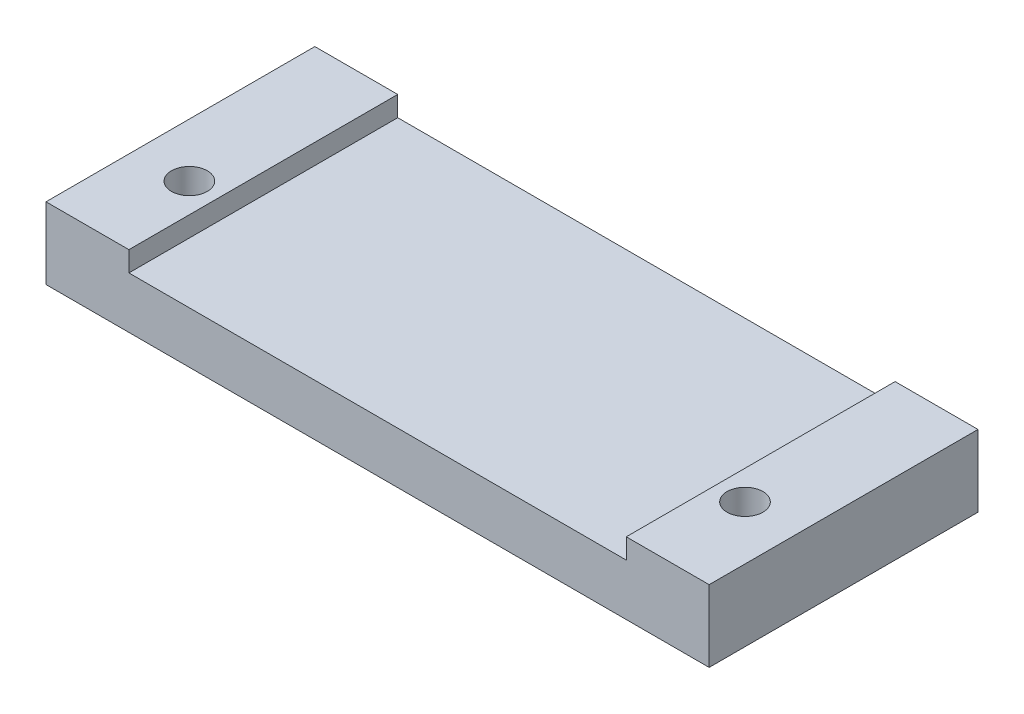
ISO-10303-21;
HEADER;
FILE_DESCRIPTION(('STEP AP214'),'2;1');
FILE_NAME('part.step','',(''),(''),'','','');
FILE_SCHEMA(('AUTOMOTIVE_DESIGN { 1 0 10303 214 1 1 1 1 }'));
ENDSEC;
DATA;
#1=APPLICATION_CONTEXT('core data for automotive mechanical design processes');
#2=APPLICATION_PROTOCOL_DEFINITION('international standard','automotive_design',2000,#1);
#3=PRODUCT_CONTEXT('',#1,'mechanical');
#4=PRODUCT('Part','Part','',(#3));
#5=PRODUCT_RELATED_PRODUCT_CATEGORY('part','',(#4));
#6=PRODUCT_DEFINITION_FORMATION('','',#4);
#7=PRODUCT_DEFINITION_CONTEXT('part definition',#1,'design');
#8=PRODUCT_DEFINITION('design','',#6,#7);
#9=PRODUCT_DEFINITION_SHAPE('','',#8);
#10=(LENGTH_UNIT() NAMED_UNIT(*) SI_UNIT(.MILLI.,.METRE.));
#11=(NAMED_UNIT(*) PLANE_ANGLE_UNIT() SI_UNIT($,.RADIAN.));
#12=(NAMED_UNIT(*) SI_UNIT($,.STERADIAN.) SOLID_ANGLE_UNIT());
#13=UNCERTAINTY_MEASURE_WITH_UNIT(LENGTH_MEASURE(1.E-05),#10,'distance_accuracy_value','');
#14=(GEOMETRIC_REPRESENTATION_CONTEXT(3) GLOBAL_UNCERTAINTY_ASSIGNED_CONTEXT((#13)) GLOBAL_UNIT_ASSIGNED_CONTEXT((#10,
#11,#12)) REPRESENTATION_CONTEXT('',''));
#15=CARTESIAN_POINT('',(0.,0.,0.));
#16=DIRECTION('',(0.,0.,1.));
#17=DIRECTION('',(1.,0.,0.));
#18=AXIS2_PLACEMENT_3D('',#15,#16,#17);
#19=CARTESIAN_POINT('',(0.,5.75,0.));
#20=DIRECTION('',(0.,-1.,0.));
#21=DIRECTION('',(0.,0.,-1.));
#22=AXIS2_PLACEMENT_3D('',#19,#20,#21);
#23=PLANE('',#22);
#24=DIRECTION('',(0.,0.,1.));
#25=VECTOR('',#24,1.);
#26=CARTESIAN_POINT('',(64.75,5.75,-30.));
#27=LINE('',#26,#25);
#28=CARTESIAN_POINT('',(64.75,5.75,-30.));
#29=VERTEX_POINT('',#28);
#30=CARTESIAN_POINT('',(64.75,5.75,0.));
#31=VERTEX_POINT('',#30);
#32=EDGE_CURVE('E114',#29,#31,#27,.T.);
#33=ORIENTED_EDGE('',*,*,#32,.F.);
#34=DIRECTION('',(-1.,0.,0.));
#35=VECTOR('',#34,1.);
#36=CARTESIAN_POINT('',(0.,5.75,-30.));
#37=LINE('',#36,#35);
#38=CARTESIAN_POINT('',(9.25,5.75,-30.));
#39=VERTEX_POINT('',#38);
#40=EDGE_CURVE('E103',#29,#39,#37,.T.);
#41=ORIENTED_EDGE('',*,*,#40,.T.);
#42=DIRECTION('',(0.,0.,-1.));
#43=VECTOR('',#42,1.);
#44=CARTESIAN_POINT('',(9.25,5.75,-30.));
#45=LINE('',#44,#43);
#46=CARTESIAN_POINT('',(9.25,5.75,0.));
#47=VERTEX_POINT('',#46);
#48=EDGE_CURVE('E59',#47,#39,#45,.T.);
#49=ORIENTED_EDGE('',*,*,#48,.F.);
#50=DIRECTION('',(1.,0.,0.));
#51=VECTOR('',#50,1.);
#52=CARTESIAN_POINT('',(0.,5.75,0.));
#53=LINE('',#52,#51);
#54=EDGE_CURVE('E54',#47,#31,#53,.T.);
#55=ORIENTED_EDGE('',*,*,#54,.T.);
#56=EDGE_LOOP('',(#33,#41,#49,#55));
#57=FACE_BOUND('',#56,.T.);
#58=ADVANCED_FACE('F39',(#57),#23,.F.);
#59=CARTESIAN_POINT('',(0.,5.75,0.));
#60=DIRECTION('',(1.,0.,0.));
#61=DIRECTION('',(0.,0.,-1.));
#62=AXIS2_PLACEMENT_3D('',#59,#60,#61);
#63=PLANE('',#62);
#64=DIRECTION('',(0.,0.,1.));
#65=VECTOR('',#64,1.);
#66=CARTESIAN_POINT('',(0.,0.,0.));
#67=LINE('',#66,#65);
#68=CARTESIAN_POINT('',(0.,0.,-30.));
#69=VERTEX_POINT('',#68);
#70=CARTESIAN_POINT('',(0.,0.,0.));
#71=VERTEX_POINT('',#70);
#72=EDGE_CURVE('E156',#69,#71,#67,.T.);
#73=ORIENTED_EDGE('',*,*,#72,.T.);
#74=DIRECTION('',(0.,-1.,0.));
#75=VECTOR('',#74,1.);
#76=CARTESIAN_POINT('',(0.,5.75,0.));
#77=LINE('',#76,#75);
#78=CARTESIAN_POINT('',(0.,8.,0.));
#79=VERTEX_POINT('',#78);
#80=EDGE_CURVE('E11',#79,#71,#77,.T.);
#81=ORIENTED_EDGE('',*,*,#80,.F.);
#82=DIRECTION('',(0.,0.,1.));
#83=VECTOR('',#82,1.);
#84=CARTESIAN_POINT('',(0.,8.,-30.));
#85=LINE('',#84,#83);
#86=CARTESIAN_POINT('',(0.,8.,-30.));
#87=VERTEX_POINT('',#86);
#88=EDGE_CURVE('E141',#87,#79,#85,.T.);
#89=ORIENTED_EDGE('',*,*,#88,.F.);
#90=DIRECTION('',(0.,-1.,0.));
#91=VECTOR('',#90,1.);
#92=CARTESIAN_POINT('',(0.,5.75,-30.));
#93=LINE('',#92,#91);
#94=EDGE_CURVE('E112',#87,#69,#93,.T.);
#95=ORIENTED_EDGE('',*,*,#94,.T.);
#96=EDGE_LOOP('',(#73,#81,#89,#95));
#97=FACE_BOUND('',#96,.T.);
#98=ADVANCED_FACE('F41',(#97),#63,.F.);
#99=CARTESIAN_POINT('',(0.,5.75,0.));
#100=DIRECTION('',(0.,0.,-1.));
#101=DIRECTION('',(-1.,0.,0.));
#102=AXIS2_PLACEMENT_3D('',#99,#100,#101);
#103=PLANE('',#102);
#104=DIRECTION('',(1.,0.,0.));
#105=VECTOR('',#104,1.);
#106=CARTESIAN_POINT('',(0.,0.,0.));
#107=LINE('',#106,#105);
#108=CARTESIAN_POINT('',(74.,0.,0.));
#109=VERTEX_POINT('',#108);
#110=EDGE_CURVE('E161',#71,#109,#107,.T.);
#111=ORIENTED_EDGE('',*,*,#110,.T.);
#112=DIRECTION('',(0.,-1.,0.));
#113=VECTOR('',#112,1.);
#114=CARTESIAN_POINT('',(74.,5.75,0.));
#115=LINE('',#114,#113);
#116=CARTESIAN_POINT('',(74.,8.,0.));
#117=VERTEX_POINT('',#116);
#118=EDGE_CURVE('E47',#117,#109,#115,.T.);
#119=ORIENTED_EDGE('',*,*,#118,.F.);
#120=DIRECTION('',(1.,0.,0.));
#121=VECTOR('',#120,1.);
#122=CARTESIAN_POINT('',(74.,8.,0.));
#123=LINE('',#122,#121);
#124=CARTESIAN_POINT('',(64.75,8.,0.));
#125=VERTEX_POINT('',#124);
#126=EDGE_CURVE('E125',#125,#117,#123,.T.);
#127=ORIENTED_EDGE('',*,*,#126,.F.);
#128=DIRECTION('',(0.,-1.,0.));
#129=VECTOR('',#128,1.);
#130=CARTESIAN_POINT('',(64.75,8.,0.));
#131=LINE('',#130,#129);
#132=EDGE_CURVE('E122',#125,#31,#131,.T.);
#133=ORIENTED_EDGE('',*,*,#132,.T.);
#134=ORIENTED_EDGE('',*,*,#54,.F.);
#135=DIRECTION('',(0.,-1.,0.));
#136=VECTOR('',#135,1.);
#137=CARTESIAN_POINT('',(9.25,8.,0.));
#138=LINE('',#137,#136);
#139=CARTESIAN_POINT('',(9.25,8.,0.));
#140=VERTEX_POINT('',#139);
#141=EDGE_CURVE('E153',#140,#47,#138,.T.);
#142=ORIENTED_EDGE('',*,*,#141,.F.);
#143=DIRECTION('',(1.,0.,0.));
#144=VECTOR('',#143,1.);
#145=CARTESIAN_POINT('',(0.,8.,0.));
#146=LINE('',#145,#144);
#147=EDGE_CURVE('E144',#79,#140,#146,.T.);
#148=ORIENTED_EDGE('',*,*,#147,.F.);
#149=ORIENTED_EDGE('',*,*,#80,.T.);
#150=EDGE_LOOP('',(#111,#119,#127,#133,#134,#142,#148,#149));
#151=FACE_BOUND('',#150,.T.);
#152=ADVANCED_FACE('F190',(#151),#103,.F.);
#153=CARTESIAN_POINT('',(74.,5.75,0.));
#154=DIRECTION('',(-1.,0.,0.));
#155=DIRECTION('',(0.,0.,1.));
#156=AXIS2_PLACEMENT_3D('',#153,#154,#155);
#157=PLANE('',#156);
#158=DIRECTION('',(0.,0.,-1.));
#159=VECTOR('',#158,1.);
#160=CARTESIAN_POINT('',(74.,0.,0.));
#161=LINE('',#160,#159);
#162=CARTESIAN_POINT('',(74.,0.,-30.));
#163=VERTEX_POINT('',#162);
#164=EDGE_CURVE('E163',#109,#163,#161,.T.);
#165=ORIENTED_EDGE('',*,*,#164,.T.);
#166=DIRECTION('',(0.,-1.,0.));
#167=VECTOR('',#166,1.);
#168=CARTESIAN_POINT('',(74.,5.75,-30.));
#169=LINE('',#168,#167);
#170=CARTESIAN_POINT('',(74.,8.,-30.));
#171=VERTEX_POINT('',#170);
#172=EDGE_CURVE('E168',#171,#163,#169,.T.);
#173=ORIENTED_EDGE('',*,*,#172,.F.);
#174=DIRECTION('',(0.,0.,-1.));
#175=VECTOR('',#174,1.);
#176=CARTESIAN_POINT('',(74.,8.,-30.));
#177=LINE('',#176,#175);
#178=EDGE_CURVE('E118',#117,#171,#177,.T.);
#179=ORIENTED_EDGE('',*,*,#178,.F.);
#180=ORIENTED_EDGE('',*,*,#118,.T.);
#181=EDGE_LOOP('',(#165,#173,#179,#180));
#182=FACE_BOUND('',#181,.T.);
#183=ADVANCED_FACE('F174',(#182),#157,.F.);
#184=CARTESIAN_POINT('',(0.,5.75,-30.));
#185=DIRECTION('',(0.,0.,1.));
#186=DIRECTION('',(1.,0.,0.));
#187=AXIS2_PLACEMENT_3D('',#184,#185,#186);
#188=PLANE('',#187);
#189=DIRECTION('',(-1.,0.,0.));
#190=VECTOR('',#189,1.);
#191=CARTESIAN_POINT('',(0.,0.,-30.));
#192=LINE('',#191,#190);
#193=EDGE_CURVE('E157',#163,#69,#192,.T.);
#194=ORIENTED_EDGE('',*,*,#193,.T.);
#195=ORIENTED_EDGE('',*,*,#94,.F.);
#196=DIRECTION('',(-1.,0.,0.));
#197=VECTOR('',#196,1.);
#198=CARTESIAN_POINT('',(0.,8.,-30.));
#199=LINE('',#198,#197);
#200=CARTESIAN_POINT('',(9.25,8.,-30.));
#201=VERTEX_POINT('',#200);
#202=EDGE_CURVE('E148',#201,#87,#199,.T.);
#203=ORIENTED_EDGE('',*,*,#202,.F.);
#204=DIRECTION('',(0.,-1.,0.));
#205=VECTOR('',#204,1.);
#206=CARTESIAN_POINT('',(9.25,8.,-30.));
#207=LINE('',#206,#205);
#208=EDGE_CURVE('E111',#201,#39,#207,.T.);
#209=ORIENTED_EDGE('',*,*,#208,.T.);
#210=ORIENTED_EDGE('',*,*,#40,.F.);
#211=DIRECTION('',(0.,-1.,0.));
#212=VECTOR('',#211,1.);
#213=CARTESIAN_POINT('',(64.75,8.,-30.));
#214=LINE('',#213,#212);
#215=CARTESIAN_POINT('',(64.75,8.,-30.));
#216=VERTEX_POINT('',#215);
#217=EDGE_CURVE('E107',#216,#29,#214,.T.);
#218=ORIENTED_EDGE('',*,*,#217,.F.);
#219=DIRECTION('',(-1.,0.,0.));
#220=VECTOR('',#219,1.);
#221=CARTESIAN_POINT('',(74.,8.,-30.));
#222=LINE('',#221,#220);
#223=EDGE_CURVE('E137',#171,#216,#222,.T.);
#224=ORIENTED_EDGE('',*,*,#223,.F.);
#225=ORIENTED_EDGE('',*,*,#172,.T.);
#226=EDGE_LOOP('',(#194,#195,#203,#209,#210,#218,#224,#225));
#227=FACE_BOUND('',#226,.T.);
#228=ADVANCED_FACE('F104',(#227),#188,.F.);
#229=CARTESIAN_POINT('',(0.,0.,0.));
#230=DIRECTION('',(0.,-1.,0.));
#231=DIRECTION('',(0.,0.,-1.));
#232=AXIS2_PLACEMENT_3D('',#229,#230,#231);
#233=PLANE('',#232);
#234=CARTESIAN_POINT('',(68.,0.,-10.));
#235=DIRECTION('',(0.,-1.,0.));
#236=DIRECTION('',(0.,0.,-1.));
#237=AXIS2_PLACEMENT_3D('',#234,#235,#236);
#238=CIRCLE('',#237,2.);
#239=CARTESIAN_POINT('',(68.,0.,-12.));
#240=VERTEX_POINT('',#239);
#241=EDGE_CURVE('E128',#240,#240,#238,.T.);
#242=ORIENTED_EDGE('',*,*,#241,.F.);
#243=EDGE_LOOP('',(#242));
#244=FACE_BOUND('',#243,.T.);
#245=CARTESIAN_POINT('',(6.,0.,-10.));
#246=DIRECTION('',(0.,-1.,0.));
#247=DIRECTION('',(0.,0.,-1.));
#248=AXIS2_PLACEMENT_3D('',#245,#246,#247);
#249=CIRCLE('',#248,2.);
#250=CARTESIAN_POINT('',(6.,0.,-12.));
#251=VERTEX_POINT('',#250);
#252=EDGE_CURVE('E290',#251,#251,#249,.T.);
#253=ORIENTED_EDGE('',*,*,#252,.F.);
#254=EDGE_LOOP('',(#253));
#255=FACE_BOUND('',#254,.T.);
#256=ORIENTED_EDGE('',*,*,#72,.F.);
#257=ORIENTED_EDGE('',*,*,#193,.F.);
#258=ORIENTED_EDGE('',*,*,#164,.F.);
#259=ORIENTED_EDGE('',*,*,#110,.F.);
#260=EDGE_LOOP('',(#256,#257,#258,#259));
#261=FACE_BOUND('',#260,.T.);
#262=ADVANCED_FACE('F180',(#244,#255,#261),#233,.T.);
#263=CARTESIAN_POINT('',(9.25,8.,-30.));
#264=DIRECTION('',(-1.,0.,0.));
#265=DIRECTION('',(0.,0.,1.));
#266=AXIS2_PLACEMENT_3D('',#263,#264,#265);
#267=PLANE('',#266);
#268=ORIENTED_EDGE('',*,*,#48,.T.);
#269=ORIENTED_EDGE('',*,*,#208,.F.);
#270=DIRECTION('',(0.,0.,-1.));
#271=VECTOR('',#270,1.);
#272=CARTESIAN_POINT('',(9.25,8.,-30.));
#273=LINE('',#272,#271);
#274=EDGE_CURVE('E146',#140,#201,#273,.T.);
#275=ORIENTED_EDGE('',*,*,#274,.F.);
#276=ORIENTED_EDGE('',*,*,#141,.T.);
#277=EDGE_LOOP('',(#268,#269,#275,#276));
#278=FACE_BOUND('',#277,.T.);
#279=ADVANCED_FACE('F189',(#278),#267,.F.);
#280=CARTESIAN_POINT('',(0.,8.,0.));
#281=DIRECTION('',(0.,1.,0.));
#282=DIRECTION('',(0.,0.,1.));
#283=AXIS2_PLACEMENT_3D('',#280,#281,#282);
#284=PLANE('',#283);
#285=CARTESIAN_POINT('',(6.,8.,-10.));
#286=DIRECTION('',(0.,-1.,0.));
#287=DIRECTION('',(0.,0.,-1.));
#288=AXIS2_PLACEMENT_3D('',#285,#286,#287);
#289=CIRCLE('',#288,2.);
#290=CARTESIAN_POINT('',(6.,8.,-12.));
#291=VERTEX_POINT('',#290);
#292=EDGE_CURVE('E131',#291,#291,#289,.T.);
#293=ORIENTED_EDGE('',*,*,#292,.T.);
#294=EDGE_LOOP('',(#293));
#295=FACE_BOUND('',#294,.T.);
#296=ORIENTED_EDGE('',*,*,#88,.T.);
#297=ORIENTED_EDGE('',*,*,#147,.T.);
#298=ORIENTED_EDGE('',*,*,#274,.T.);
#299=ORIENTED_EDGE('',*,*,#202,.T.);
#300=EDGE_LOOP('',(#296,#297,#298,#299));
#301=FACE_BOUND('',#300,.T.);
#302=ADVANCED_FACE('F185',(#295,#301),#284,.T.);
#303=CARTESIAN_POINT('',(64.75,8.,-30.));
#304=DIRECTION('',(1.,0.,0.));
#305=DIRECTION('',(0.,0.,-1.));
#306=AXIS2_PLACEMENT_3D('',#303,#304,#305);
#307=PLANE('',#306);
#308=ORIENTED_EDGE('',*,*,#32,.T.);
#309=ORIENTED_EDGE('',*,*,#132,.F.);
#310=DIRECTION('',(0.,0.,1.));
#311=VECTOR('',#310,1.);
#312=CARTESIAN_POINT('',(64.75,8.,-30.));
#313=LINE('',#312,#311);
#314=EDGE_CURVE('E121',#216,#125,#313,.T.);
#315=ORIENTED_EDGE('',*,*,#314,.F.);
#316=ORIENTED_EDGE('',*,*,#217,.T.);
#317=EDGE_LOOP('',(#308,#309,#315,#316));
#318=FACE_BOUND('',#317,.T.);
#319=ADVANCED_FACE('F120',(#318),#307,.F.);
#320=CARTESIAN_POINT('',(0.,8.,0.));
#321=DIRECTION('',(0.,-1.,0.));
#322=DIRECTION('',(0.,0.,-1.));
#323=AXIS2_PLACEMENT_3D('',#320,#321,#322);
#324=PLANE('',#323);
#325=CARTESIAN_POINT('',(68.,8.,-10.));
#326=DIRECTION('',(0.,-1.,0.));
#327=DIRECTION('',(0.,0.,-1.));
#328=AXIS2_PLACEMENT_3D('',#325,#326,#327);
#329=CIRCLE('',#328,2.);
#330=CARTESIAN_POINT('',(68.,8.,-12.));
#331=VERTEX_POINT('',#330);
#332=EDGE_CURVE('E123',#331,#331,#329,.T.);
#333=ORIENTED_EDGE('',*,*,#332,.T.);
#334=EDGE_LOOP('',(#333));
#335=FACE_BOUND('',#334,.T.);
#336=ORIENTED_EDGE('',*,*,#178,.T.);
#337=ORIENTED_EDGE('',*,*,#223,.T.);
#338=ORIENTED_EDGE('',*,*,#314,.T.);
#339=ORIENTED_EDGE('',*,*,#126,.T.);
#340=EDGE_LOOP('',(#336,#337,#338,#339));
#341=FACE_BOUND('',#340,.T.);
#342=ADVANCED_FACE('F192',(#335,#341),#324,.F.);
#343=CARTESIAN_POINT('',(68.,8.,-10.));
#344=DIRECTION('',(0.,-1.,0.));
#345=DIRECTION('',(0.,0.,-1.));
#346=AXIS2_PLACEMENT_3D('',#343,#344,#345);
#347=CYLINDRICAL_SURFACE('',#346,2.);
#348=ORIENTED_EDGE('',*,*,#332,.F.);
#349=EDGE_LOOP('',(#348));
#350=FACE_BOUND('',#349,.T.);
#351=ORIENTED_EDGE('',*,*,#241,.T.);
#352=EDGE_LOOP('',(#351));
#353=FACE_BOUND('',#352,.T.);
#354=ADVANCED_FACE('F194',(#350,#353),#347,.F.);
#355=CARTESIAN_POINT('',(6.,8.,-10.));
#356=DIRECTION('',(0.,-1.,0.));
#357=DIRECTION('',(0.,0.,-1.));
#358=AXIS2_PLACEMENT_3D('',#355,#356,#357);
#359=CYLINDRICAL_SURFACE('',#358,2.);
#360=ORIENTED_EDGE('',*,*,#292,.F.);
#361=EDGE_LOOP('',(#360));
#362=FACE_BOUND('',#361,.T.);
#363=ORIENTED_EDGE('',*,*,#252,.T.);
#364=EDGE_LOOP('',(#363));
#365=FACE_BOUND('',#364,.T.);
#366=ADVANCED_FACE('F201',(#362,#365),#359,.F.);
#367=CLOSED_SHELL('',(#58,#98,#152,#183,#228,#262,#279,#302,#319,#342,#354,#366));
#368=MANIFOLD_SOLID_BREP('B2',#367);
#369=ADVANCED_BREP_SHAPE_REPRESENTATION('',(#18,#368),#14);
#370=SHAPE_DEFINITION_REPRESENTATION(#9,#369);
ENDSEC;
END-ISO-10303-21;
